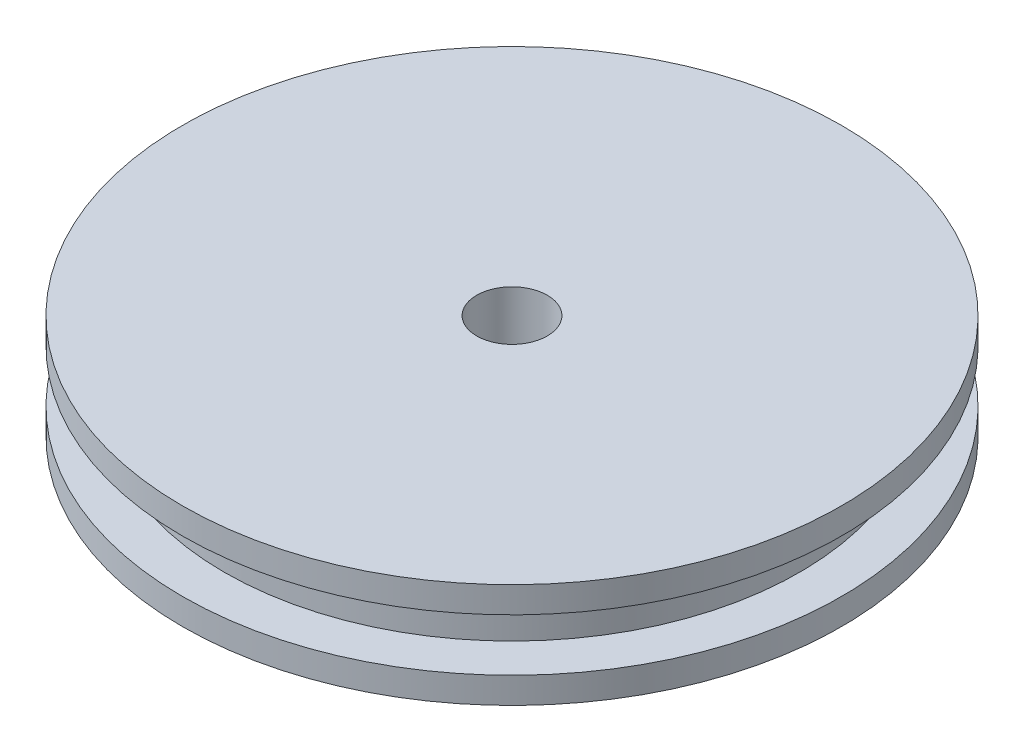
ISO-10303-21;
HEADER;
FILE_DESCRIPTION(('STEP AP214'),'2;1');
FILE_NAME('part.step','',(''),(''),'','','');
FILE_SCHEMA(('AUTOMOTIVE_DESIGN { 1 0 10303 214 1 1 1 1 }'));
ENDSEC;
DATA;
#1=APPLICATION_CONTEXT('core data for automotive mechanical design processes');
#2=APPLICATION_PROTOCOL_DEFINITION('international standard','automotive_design',2000,#1);
#3=PRODUCT_CONTEXT('',#1,'mechanical');
#4=PRODUCT('Part','Part','',(#3));
#5=PRODUCT_RELATED_PRODUCT_CATEGORY('part','',(#4));
#6=PRODUCT_DEFINITION_FORMATION('','',#4);
#7=PRODUCT_DEFINITION_CONTEXT('part definition',#1,'design');
#8=PRODUCT_DEFINITION('design','',#6,#7);
#9=PRODUCT_DEFINITION_SHAPE('','',#8);
#10=(LENGTH_UNIT() NAMED_UNIT(*) SI_UNIT(.MILLI.,.METRE.));
#11=(NAMED_UNIT(*) PLANE_ANGLE_UNIT() SI_UNIT($,.RADIAN.));
#12=(NAMED_UNIT(*) SI_UNIT($,.STERADIAN.) SOLID_ANGLE_UNIT());
#13=UNCERTAINTY_MEASURE_WITH_UNIT(LENGTH_MEASURE(1.E-05),#10,'distance_accuracy_value','');
#14=(GEOMETRIC_REPRESENTATION_CONTEXT(3) GLOBAL_UNCERTAINTY_ASSIGNED_CONTEXT((#13)) GLOBAL_UNIT_ASSIGNED_CONTEXT((#10,
#11,#12)) REPRESENTATION_CONTEXT('',''));
#15=CARTESIAN_POINT('',(0.,0.,0.));
#16=DIRECTION('',(0.,0.,1.));
#17=DIRECTION('',(1.,0.,0.));
#18=AXIS2_PLACEMENT_3D('',#15,#16,#17);
#19=CARTESIAN_POINT('',(0.,0.5,0.));
#20=DIRECTION('',(0.,1.,0.));
#21=DIRECTION('',(0.,0.,1.));
#22=AXIS2_PLACEMENT_3D('',#19,#20,#21);
#23=PLANE('',#22);
#24=CARTESIAN_POINT('',(0.,0.5,0.));
#25=DIRECTION('',(0.,1.,0.));
#26=DIRECTION('',(0.,0.,1.));
#27=AXIS2_PLACEMENT_3D('',#24,#25,#26);
#28=CIRCLE('',#27,6.3);
#29=CARTESIAN_POINT('',(0.,0.5,6.3));
#30=VERTEX_POINT('',#29);
#31=EDGE_CURVE('E10',#30,#30,#28,.T.);
#32=ORIENTED_EDGE('',*,*,#31,.T.);
#33=EDGE_LOOP('',(#32));
#34=FACE_BOUND('',#33,.T.);
#35=CARTESIAN_POINT('',(0.,0.5,0.));
#36=DIRECTION('',(0.,1.,0.));
#37=DIRECTION('',(0.,0.,1.));
#38=AXIS2_PLACEMENT_3D('',#35,#36,#37);
#39=CIRCLE('',#38,5.5);
#40=CARTESIAN_POINT('',(0.,0.5,5.5));
#41=VERTEX_POINT('',#40);
#42=EDGE_CURVE('E46',#41,#41,#39,.T.);
#43=ORIENTED_EDGE('',*,*,#42,.F.);
#44=EDGE_LOOP('',(#43));
#45=FACE_BOUND('',#44,.T.);
#46=ADVANCED_FACE('F33',(#34,#45),#23,.T.);
#47=CARTESIAN_POINT('',(0.,0.5,0.));
#48=DIRECTION('',(0.,-1.,0.));
#49=DIRECTION('',(0.,0.,-1.));
#50=AXIS2_PLACEMENT_3D('',#47,#48,#49);
#51=CYLINDRICAL_SURFACE('',#50,6.3);
#52=ORIENTED_EDGE('',*,*,#31,.F.);
#53=EDGE_LOOP('',(#52));
#54=FACE_BOUND('',#53,.T.);
#55=CARTESIAN_POINT('',(0.,0.,0.));
#56=DIRECTION('',(0.,1.,0.));
#57=DIRECTION('',(0.,0.,1.));
#58=AXIS2_PLACEMENT_3D('',#55,#56,#57);
#59=CIRCLE('',#58,6.3);
#60=CARTESIAN_POINT('',(0.,0.,6.3));
#61=VERTEX_POINT('',#60);
#62=EDGE_CURVE('E37',#61,#61,#59,.T.);
#63=ORIENTED_EDGE('',*,*,#62,.T.);
#64=EDGE_LOOP('',(#63));
#65=FACE_BOUND('',#64,.T.);
#66=ADVANCED_FACE('F35',(#54,#65),#51,.T.);
#67=CARTESIAN_POINT('',(0.,0.,0.));
#68=DIRECTION('',(0.,1.,0.));
#69=DIRECTION('',(0.,0.,1.));
#70=AXIS2_PLACEMENT_3D('',#67,#68,#69);
#71=PLANE('',#70);
#72=CARTESIAN_POINT('',(0.,0.,0.));
#73=DIRECTION('',(0.,-1.,0.));
#74=DIRECTION('',(0.,0.,-1.));
#75=AXIS2_PLACEMENT_3D('',#72,#73,#74);
#76=CIRCLE('',#75,0.675);
#77=CARTESIAN_POINT('',(0.,0.,-0.675));
#78=VERTEX_POINT('',#77);
#79=EDGE_CURVE('E55',#78,#78,#76,.T.);
#80=ORIENTED_EDGE('',*,*,#79,.F.);
#81=EDGE_LOOP('',(#80));
#82=FACE_BOUND('',#81,.T.);
#83=ORIENTED_EDGE('',*,*,#62,.F.);
#84=EDGE_LOOP('',(#83));
#85=FACE_BOUND('',#84,.T.);
#86=ADVANCED_FACE('F66',(#82,#85),#71,.F.);
#87=CARTESIAN_POINT('',(0.,1.5,0.));
#88=DIRECTION('',(0.,-1.,0.));
#89=DIRECTION('',(0.,0.,-1.));
#90=AXIS2_PLACEMENT_3D('',#87,#88,#89);
#91=CYLINDRICAL_SURFACE('',#90,5.5);
#92=CARTESIAN_POINT('',(0.,1.5,0.));
#93=DIRECTION('',(0.,1.,0.));
#94=DIRECTION('',(0.,0.,1.));
#95=AXIS2_PLACEMENT_3D('',#92,#93,#94);
#96=CIRCLE('',#95,5.5);
#97=CARTESIAN_POINT('',(0.,1.5,5.5));
#98=VERTEX_POINT('',#97);
#99=EDGE_CURVE('E44',#98,#98,#96,.T.);
#100=ORIENTED_EDGE('',*,*,#99,.F.);
#101=EDGE_LOOP('',(#100));
#102=FACE_BOUND('',#101,.T.);
#103=ORIENTED_EDGE('',*,*,#42,.T.);
#104=EDGE_LOOP('',(#103));
#105=FACE_BOUND('',#104,.T.);
#106=ADVANCED_FACE('F69',(#102,#105),#91,.T.);
#107=CARTESIAN_POINT('',(0.,1.5,0.));
#108=DIRECTION('',(0.,1.,0.));
#109=DIRECTION('',(0.,0.,1.));
#110=AXIS2_PLACEMENT_3D('',#107,#108,#109);
#111=PLANE('',#110);
#112=CARTESIAN_POINT('',(0.,1.5,0.));
#113=DIRECTION('',(0.,1.,0.));
#114=DIRECTION('',(0.,0.,1.));
#115=AXIS2_PLACEMENT_3D('',#112,#113,#114);
#116=CIRCLE('',#115,6.3);
#117=CARTESIAN_POINT('',(0.,1.5,6.3));
#118=VERTEX_POINT('',#117);
#119=EDGE_CURVE('E52',#118,#118,#116,.T.);
#120=ORIENTED_EDGE('',*,*,#119,.F.);
#121=EDGE_LOOP('',(#120));
#122=FACE_BOUND('',#121,.T.);
#123=ORIENTED_EDGE('',*,*,#99,.T.);
#124=EDGE_LOOP('',(#123));
#125=FACE_BOUND('',#124,.T.);
#126=ADVANCED_FACE('F84',(#122,#125),#111,.F.);
#127=CARTESIAN_POINT('',(0.,2.,0.));
#128=DIRECTION('',(0.,-1.,0.));
#129=DIRECTION('',(0.,0.,-1.));
#130=AXIS2_PLACEMENT_3D('',#127,#128,#129);
#131=CYLINDRICAL_SURFACE('',#130,6.3);
#132=CARTESIAN_POINT('',(0.,2.,0.));
#133=DIRECTION('',(0.,1.,0.));
#134=DIRECTION('',(0.,0.,1.));
#135=AXIS2_PLACEMENT_3D('',#132,#133,#134);
#136=CIRCLE('',#135,6.3);
#137=CARTESIAN_POINT('',(0.,2.,6.3));
#138=VERTEX_POINT('',#137);
#139=EDGE_CURVE('E49',#138,#138,#136,.T.);
#140=ORIENTED_EDGE('',*,*,#139,.F.);
#141=EDGE_LOOP('',(#140));
#142=FACE_BOUND('',#141,.T.);
#143=ORIENTED_EDGE('',*,*,#119,.T.);
#144=EDGE_LOOP('',(#143));
#145=FACE_BOUND('',#144,.T.);
#146=ADVANCED_FACE('F86',(#142,#145),#131,.T.);
#147=CARTESIAN_POINT('',(0.,2.,0.));
#148=DIRECTION('',(0.,1.,0.));
#149=DIRECTION('',(0.,0.,1.));
#150=AXIS2_PLACEMENT_3D('',#147,#148,#149);
#151=PLANE('',#150);
#152=CARTESIAN_POINT('',(0.,2.,0.));
#153=DIRECTION('',(0.,1.,0.));
#154=DIRECTION('',(0.,0.,1.));
#155=AXIS2_PLACEMENT_3D('',#152,#153,#154);
#156=CIRCLE('',#155,0.675);
#157=CARTESIAN_POINT('',(0.,2.,0.675));
#158=VERTEX_POINT('',#157);
#159=EDGE_CURVE('E58',#158,#158,#156,.F.);
#160=ORIENTED_EDGE('',*,*,#159,.T.);
#161=EDGE_LOOP('',(#160));
#162=FACE_BOUND('',#161,.T.);
#163=ORIENTED_EDGE('',*,*,#139,.T.);
#164=EDGE_LOOP('',(#163));
#165=FACE_BOUND('',#164,.T.);
#166=ADVANCED_FACE('F89',(#162,#165),#151,.T.);
#167=CARTESIAN_POINT('',(0.,2.001,0.));
#168=DIRECTION('',(0.,-1.,0.));
#169=DIRECTION('',(0.,0.,-1.));
#170=AXIS2_PLACEMENT_3D('',#167,#168,#169);
#171=CYLINDRICAL_SURFACE('',#170,0.675);
#172=ORIENTED_EDGE('',*,*,#159,.F.);
#173=EDGE_LOOP('',(#172));
#174=FACE_BOUND('',#173,.T.);
#175=ORIENTED_EDGE('',*,*,#79,.T.);
#176=EDGE_LOOP('',(#175));
#177=FACE_BOUND('',#176,.T.);
#178=ADVANCED_FACE('F64',(#174,#177),#171,.F.);
#179=CLOSED_SHELL('',(#46,#66,#86,#106,#126,#146,#166,#178));
#180=MANIFOLD_SOLID_BREP('B2',#179);
#181=ADVANCED_BREP_SHAPE_REPRESENTATION('',(#18,#180),#14);
#182=SHAPE_DEFINITION_REPRESENTATION(#9,#181);
ENDSEC;
END-ISO-10303-21;
